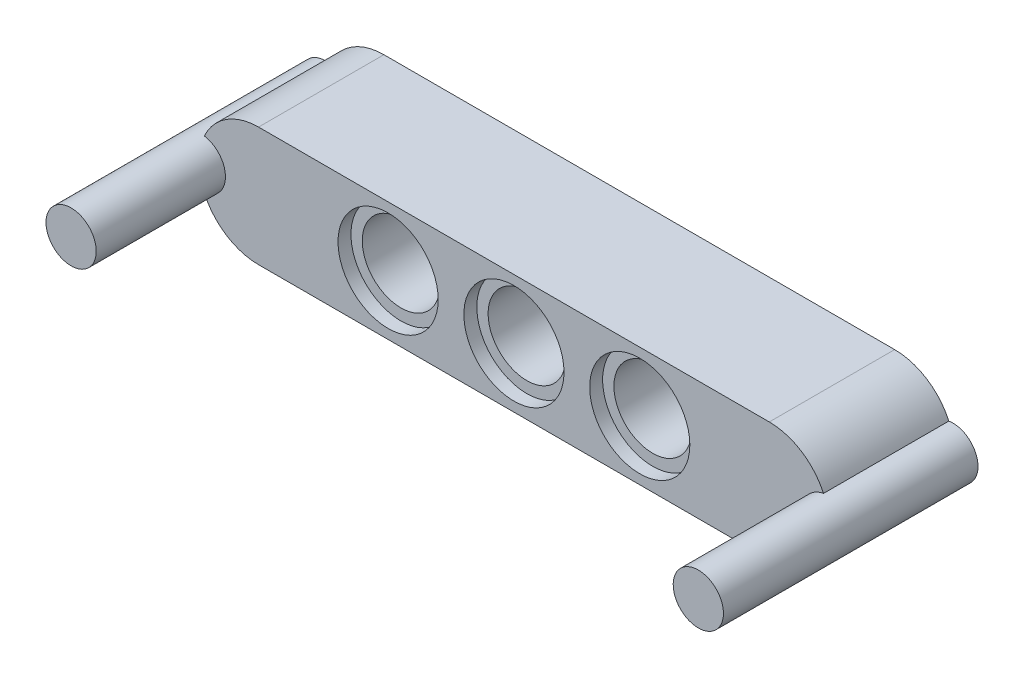
ISO-10303-21;
HEADER;
FILE_DESCRIPTION(('STEP AP214'),'2;1');
FILE_NAME('part.step','',(''),(''),'','','');
FILE_SCHEMA(('AUTOMOTIVE_DESIGN { 1 0 10303 214 1 1 1 1 }'));
ENDSEC;
DATA;
#1=APPLICATION_CONTEXT('core data for automotive mechanical design processes');
#2=APPLICATION_PROTOCOL_DEFINITION('international standard','automotive_design',2000,#1);
#3=PRODUCT_CONTEXT('',#1,'mechanical');
#4=PRODUCT('Part','Part','',(#3));
#5=PRODUCT_RELATED_PRODUCT_CATEGORY('part','',(#4));
#6=PRODUCT_DEFINITION_FORMATION('','',#4);
#7=PRODUCT_DEFINITION_CONTEXT('part definition',#1,'design');
#8=PRODUCT_DEFINITION('design','',#6,#7);
#9=PRODUCT_DEFINITION_SHAPE('','',#8);
#10=(LENGTH_UNIT() NAMED_UNIT(*) SI_UNIT(.MILLI.,.METRE.));
#11=(NAMED_UNIT(*) PLANE_ANGLE_UNIT() SI_UNIT($,.RADIAN.));
#12=(NAMED_UNIT(*) SI_UNIT($,.STERADIAN.) SOLID_ANGLE_UNIT());
#13=UNCERTAINTY_MEASURE_WITH_UNIT(LENGTH_MEASURE(1.E-05),#10,'distance_accuracy_value','');
#14=(GEOMETRIC_REPRESENTATION_CONTEXT(3) GLOBAL_UNCERTAINTY_ASSIGNED_CONTEXT((#13)) GLOBAL_UNIT_ASSIGNED_CONTEXT((#10,
#11,#12)) REPRESENTATION_CONTEXT('',''));
#15=CARTESIAN_POINT('',(0.,0.,0.));
#16=DIRECTION('',(0.,0.,1.));
#17=DIRECTION('',(1.,0.,0.));
#18=AXIS2_PLACEMENT_3D('',#15,#16,#17);
#19=CARTESIAN_POINT('',(35.31,3.69,7.76));
#20=DIRECTION('',(0.,0.,1.));
#21=DIRECTION('',(1.,0.,0.));
#22=AXIS2_PLACEMENT_3D('',#19,#20,#21);
#23=CYLINDRICAL_SURFACE('',#22,3.69);
#24=DIRECTION('',(0.,0.,-1.));
#25=VECTOR('',#24,1.);
#26=CARTESIAN_POINT('',(38.6656310679612,2.15512536807275,4.));
#27=LINE('',#26,#25);
#28=CARTESIAN_POINT('',(38.6656310679612,2.15512536807275,7.76));
#29=VERTEX_POINT('',#28);
#30=CARTESIAN_POINT('',(38.6656310679612,2.15512536807275,0.));
#31=VERTEX_POINT('',#30);
#32=EDGE_CURVE('E163',#29,#31,#27,.T.);
#33=ORIENTED_EDGE('',*,*,#32,.F.);
#34=CARTESIAN_POINT('',(35.31,3.69,7.76));
#35=DIRECTION('',(0.,0.,-1.));
#36=DIRECTION('',(-1.,0.,0.));
#37=AXIS2_PLACEMENT_3D('',#34,#35,#36);
#38=CIRCLE('',#37,3.69);
#39=CARTESIAN_POINT('',(35.31,0.,7.76));
#40=VERTEX_POINT('',#39);
#41=EDGE_CURVE('E46',#40,#29,#38,.F.);
#42=ORIENTED_EDGE('',*,*,#41,.F.);
#43=DIRECTION('',(0.,0.,1.));
#44=VECTOR('',#43,1.);
#45=CARTESIAN_POINT('',(35.31,0.,7.76));
#46=LINE('',#45,#44);
#47=CARTESIAN_POINT('',(35.31,0.,0.));
#48=VERTEX_POINT('',#47);
#49=EDGE_CURVE('E146',#48,#40,#46,.T.);
#50=ORIENTED_EDGE('',*,*,#49,.F.);
#51=CARTESIAN_POINT('',(35.31,3.69,0.));
#52=DIRECTION('',(0.,0.,-1.));
#53=DIRECTION('',(-1.,0.,0.));
#54=AXIS2_PLACEMENT_3D('',#51,#52,#53);
#55=CIRCLE('',#54,3.69);
#56=EDGE_CURVE('E149',#31,#48,#55,.T.);
#57=ORIENTED_EDGE('',*,*,#56,.F.);
#58=EDGE_LOOP('',(#33,#42,#50,#57));
#59=FACE_BOUND('',#58,.T.);
#60=ADVANCED_FACE('F39',(#59),#23,.T.);
#61=CARTESIAN_POINT('',(35.31,3.69,7.76));
#62=DIRECTION('',(0.,0.,1.));
#63=DIRECTION('',(1.,0.,0.));
#64=AXIS2_PLACEMENT_3D('',#61,#62,#63);
#65=CYLINDRICAL_SURFACE('',#64,3.69);
#66=DIRECTION('',(0.,0.,-1.));
#67=VECTOR('',#66,1.);
#68=CARTESIAN_POINT('',(38.6656310679612,5.22487463192725,4.));
#69=LINE('',#68,#67);
#70=CARTESIAN_POINT('',(38.6656310679612,5.22487463192725,0.));
#71=VERTEX_POINT('',#70);
#72=CARTESIAN_POINT('',(38.6656310679612,5.22487463192725,7.76));
#73=VERTEX_POINT('',#72);
#74=EDGE_CURVE('E60',#71,#73,#69,.F.);
#75=ORIENTED_EDGE('',*,*,#74,.F.);
#76=CARTESIAN_POINT('',(35.31,3.69,0.));
#77=DIRECTION('',(0.,0.,-1.));
#78=DIRECTION('',(-1.,0.,0.));
#79=AXIS2_PLACEMENT_3D('',#76,#77,#78);
#80=CIRCLE('',#79,3.69);
#81=CARTESIAN_POINT('',(35.31,7.38,0.));
#82=VERTEX_POINT('',#81);
#83=EDGE_CURVE('E141',#82,#71,#80,.T.);
#84=ORIENTED_EDGE('',*,*,#83,.F.);
#85=DIRECTION('',(0.,0.,1.));
#86=VECTOR('',#85,1.);
#87=CARTESIAN_POINT('',(35.31,7.38,7.76));
#88=LINE('',#87,#86);
#89=CARTESIAN_POINT('',(35.31,7.38,7.76));
#90=VERTEX_POINT('',#89);
#91=EDGE_CURVE('E138',#90,#82,#88,.F.);
#92=ORIENTED_EDGE('',*,*,#91,.F.);
#93=CARTESIAN_POINT('',(35.31,3.69,7.76));
#94=DIRECTION('',(0.,0.,-1.));
#95=DIRECTION('',(-1.,0.,0.));
#96=AXIS2_PLACEMENT_3D('',#93,#94,#95);
#97=CIRCLE('',#96,3.69);
#98=EDGE_CURVE('E144',#73,#90,#97,.F.);
#99=ORIENTED_EDGE('',*,*,#98,.F.);
#100=EDGE_LOOP('',(#75,#84,#92,#99));
#101=FACE_BOUND('',#100,.T.);
#102=ADVANCED_FACE('F264',(#101),#65,.T.);
#103=CARTESIAN_POINT('',(3.69,3.69,7.76));
#104=DIRECTION('',(0.,0.,-1.));
#105=DIRECTION('',(-1.,0.,0.));
#106=AXIS2_PLACEMENT_3D('',#103,#104,#105);
#107=CYLINDRICAL_SURFACE('',#106,3.69);
#108=DIRECTION('',(0.,0.,-1.));
#109=VECTOR('',#108,1.);
#110=CARTESIAN_POINT('',(0.334368932038836,2.15512536807275,4.));
#111=LINE('',#110,#109);
#112=CARTESIAN_POINT('',(0.334368932038836,2.15512536807275,0.));
#113=VERTEX_POINT('',#112);
#114=CARTESIAN_POINT('',(0.334368932038836,2.15512536807275,7.76));
#115=VERTEX_POINT('',#114);
#116=EDGE_CURVE('E52',#113,#115,#111,.F.);
#117=ORIENTED_EDGE('',*,*,#116,.F.);
#118=CARTESIAN_POINT('',(3.69,3.69,0.));
#119=DIRECTION('',(0.,0.,-1.));
#120=DIRECTION('',(-1.,0.,0.));
#121=AXIS2_PLACEMENT_3D('',#118,#119,#120);
#122=CIRCLE('',#121,3.69);
#123=CARTESIAN_POINT('',(3.69,0.,0.));
#124=VERTEX_POINT('',#123);
#125=EDGE_CURVE('E119',#124,#113,#122,.T.);
#126=ORIENTED_EDGE('',*,*,#125,.F.);
#127=DIRECTION('',(0.,0.,-1.));
#128=VECTOR('',#127,1.);
#129=CARTESIAN_POINT('',(3.69,0.,7.76));
#130=LINE('',#129,#128);
#131=CARTESIAN_POINT('',(3.69,0.,7.76));
#132=VERTEX_POINT('',#131);
#133=EDGE_CURVE('E127',#132,#124,#130,.T.);
#134=ORIENTED_EDGE('',*,*,#133,.F.);
#135=CARTESIAN_POINT('',(3.69,3.69,7.76));
#136=DIRECTION('',(0.,0.,-1.));
#137=DIRECTION('',(-1.,0.,0.));
#138=AXIS2_PLACEMENT_3D('',#135,#136,#137);
#139=CIRCLE('',#138,3.69);
#140=EDGE_CURVE('E135',#115,#132,#139,.F.);
#141=ORIENTED_EDGE('',*,*,#140,.F.);
#142=EDGE_LOOP('',(#117,#126,#134,#141));
#143=FACE_BOUND('',#142,.T.);
#144=ADVANCED_FACE('F269',(#143),#107,.T.);
#145=CARTESIAN_POINT('',(3.69,3.69,7.76));
#146=DIRECTION('',(0.,0.,1.));
#147=DIRECTION('',(1.,0.,0.));
#148=AXIS2_PLACEMENT_3D('',#145,#146,#147);
#149=CYLINDRICAL_SURFACE('',#148,3.69);
#150=DIRECTION('',(0.,0.,-1.));
#151=VECTOR('',#150,1.);
#152=CARTESIAN_POINT('',(0.334368932038835,5.22487463192725,4.));
#153=LINE('',#152,#151);
#154=CARTESIAN_POINT('',(0.334368932038834,5.22487463192725,7.76));
#155=VERTEX_POINT('',#154);
#156=CARTESIAN_POINT('',(0.334368932038835,5.22487463192725,0.));
#157=VERTEX_POINT('',#156);
#158=EDGE_CURVE('E101',#155,#157,#153,.T.);
#159=ORIENTED_EDGE('',*,*,#158,.F.);
#160=CARTESIAN_POINT('',(3.69,3.69,7.76));
#161=DIRECTION('',(0.,0.,-1.));
#162=DIRECTION('',(-1.,0.,0.));
#163=AXIS2_PLACEMENT_3D('',#160,#161,#162);
#164=CIRCLE('',#163,3.69);
#165=CARTESIAN_POINT('',(3.69,7.38,7.76));
#166=VERTEX_POINT('',#165);
#167=EDGE_CURVE('E125',#166,#155,#164,.F.);
#168=ORIENTED_EDGE('',*,*,#167,.F.);
#169=DIRECTION('',(0.,0.,1.));
#170=VECTOR('',#169,1.);
#171=CARTESIAN_POINT('',(3.69,7.38,7.76));
#172=LINE('',#171,#170);
#173=CARTESIAN_POINT('',(3.69,7.38,0.));
#174=VERTEX_POINT('',#173);
#175=EDGE_CURVE('E124',#174,#166,#172,.T.);
#176=ORIENTED_EDGE('',*,*,#175,.F.);
#177=CARTESIAN_POINT('',(3.69,3.69,0.));
#178=DIRECTION('',(0.,0.,-1.));
#179=DIRECTION('',(-1.,0.,0.));
#180=AXIS2_PLACEMENT_3D('',#177,#178,#179);
#181=CIRCLE('',#180,3.69);
#182=EDGE_CURVE('E116',#157,#174,#181,.T.);
#183=ORIENTED_EDGE('',*,*,#182,.F.);
#184=EDGE_LOOP('',(#159,#168,#176,#183));
#185=FACE_BOUND('',#184,.T.);
#186=ADVANCED_FACE('F122',(#185),#149,.T.);
#187=CARTESIAN_POINT('',(27.29,3.69,0.));
#188=DIRECTION('',(0.,0.,1.));
#189=DIRECTION('',(1.,0.,0.));
#190=AXIS2_PLACEMENT_3D('',#187,#188,#189);
#191=CYLINDRICAL_SURFACE('',#190,3.1);
#192=CARTESIAN_POINT('',(27.29,3.69,0.));
#193=DIRECTION('',(0.,0.,1.));
#194=DIRECTION('',(1.,0.,0.));
#195=AXIS2_PLACEMENT_3D('',#192,#193,#194);
#196=CIRCLE('',#195,3.1);
#197=CARTESIAN_POINT('',(30.39,3.69,0.));
#198=VERTEX_POINT('',#197);
#199=EDGE_CURVE('E129',#198,#198,#196,.T.);
#200=ORIENTED_EDGE('',*,*,#199,.F.);
#201=EDGE_LOOP('',(#200));
#202=FACE_BOUND('',#201,.T.);
#203=CARTESIAN_POINT('',(27.29,3.69,0.8));
#204=DIRECTION('',(0.,0.,1.));
#205=DIRECTION('',(1.,0.,0.));
#206=AXIS2_PLACEMENT_3D('',#203,#204,#205);
#207=CIRCLE('',#206,3.1);
#208=CARTESIAN_POINT('',(30.39,3.69,0.8));
#209=VERTEX_POINT('',#208);
#210=EDGE_CURVE('E229',#209,#209,#207,.T.);
#211=ORIENTED_EDGE('',*,*,#210,.T.);
#212=EDGE_LOOP('',(#211));
#213=FACE_BOUND('',#212,.T.);
#214=ADVANCED_FACE('F235',(#202,#213),#191,.F.);
#215=CARTESIAN_POINT('',(7.79,0.,0.8));
#216=DIRECTION('',(0.,0.,1.));
#217=DIRECTION('',(1.,0.,0.));
#218=AXIS2_PLACEMENT_3D('',#215,#216,#217);
#219=PLANE('',#218);
#220=ORIENTED_EDGE('',*,*,#210,.F.);
#221=EDGE_LOOP('',(#220));
#222=FACE_BOUND('',#221,.T.);
#223=CARTESIAN_POINT('',(27.29,3.69,0.8));
#224=DIRECTION('',(0.,0.,1.));
#225=DIRECTION('',(1.,0.,0.));
#226=AXIS2_PLACEMENT_3D('',#223,#224,#225);
#227=CIRCLE('',#226,2.4);
#228=CARTESIAN_POINT('',(29.69,3.69,0.8));
#229=VERTEX_POINT('',#228);
#230=EDGE_CURVE('E220',#229,#229,#227,.F.);
#231=ORIENTED_EDGE('',*,*,#230,.F.);
#232=EDGE_LOOP('',(#231));
#233=FACE_BOUND('',#232,.T.);
#234=ADVANCED_FACE('F238',(#222,#233),#219,.F.);
#235=CARTESIAN_POINT('',(7.79,0.,6.95999999999999));
#236=DIRECTION('',(0.,0.,-1.));
#237=DIRECTION('',(-1.,0.,0.));
#238=AXIS2_PLACEMENT_3D('',#235,#236,#237);
#239=PLANE('',#238);
#240=CARTESIAN_POINT('',(27.29,3.69,6.96));
#241=DIRECTION('',(0.,0.,1.));
#242=DIRECTION('',(1.,0.,0.));
#243=AXIS2_PLACEMENT_3D('',#240,#241,#242);
#244=CIRCLE('',#243,3.1);
#245=CARTESIAN_POINT('',(30.39,3.69,6.96));
#246=VERTEX_POINT('',#245);
#247=EDGE_CURVE('E226',#246,#246,#244,.T.);
#248=ORIENTED_EDGE('',*,*,#247,.T.);
#249=EDGE_LOOP('',(#248));
#250=FACE_BOUND('',#249,.T.);
#251=CARTESIAN_POINT('',(27.29,3.69,6.95999999999999));
#252=DIRECTION('',(0.,0.,-1.));
#253=DIRECTION('',(-1.,0.,0.));
#254=AXIS2_PLACEMENT_3D('',#251,#252,#253);
#255=CIRCLE('',#254,2.4);
#256=CARTESIAN_POINT('',(24.89,3.69,6.95999999999999));
#257=VERTEX_POINT('',#256);
#258=EDGE_CURVE('E217',#257,#257,#255,.F.);
#259=ORIENTED_EDGE('',*,*,#258,.F.);
#260=EDGE_LOOP('',(#259));
#261=FACE_BOUND('',#260,.T.);
#262=ADVANCED_FACE('F244',(#250,#261),#239,.F.);
#263=CARTESIAN_POINT('',(27.29,3.69,7.76));
#264=DIRECTION('',(0.,0.,-1.));
#265=DIRECTION('',(-1.,0.,0.));
#266=AXIS2_PLACEMENT_3D('',#263,#264,#265);
#267=CYLINDRICAL_SURFACE('',#266,3.1);
#268=CARTESIAN_POINT('',(27.29,3.69,7.76));
#269=DIRECTION('',(0.,0.,1.));
#270=DIRECTION('',(1.,0.,0.));
#271=AXIS2_PLACEMENT_3D('',#268,#269,#270);
#272=CIRCLE('',#271,3.1);
#273=CARTESIAN_POINT('',(30.39,3.69,7.76));
#274=VERTEX_POINT('',#273);
#275=EDGE_CURVE('E223',#274,#274,#272,.T.);
#276=ORIENTED_EDGE('',*,*,#275,.T.);
#277=EDGE_LOOP('',(#276));
#278=FACE_BOUND('',#277,.T.);
#279=ORIENTED_EDGE('',*,*,#247,.F.);
#280=EDGE_LOOP('',(#279));
#281=FACE_BOUND('',#280,.T.);
#282=ADVANCED_FACE('F251',(#278,#281),#267,.F.);
#283=CARTESIAN_POINT('',(27.29,3.69,0.));
#284=DIRECTION('',(0.,0.,1.));
#285=DIRECTION('',(1.,0.,0.));
#286=AXIS2_PLACEMENT_3D('',#283,#284,#285);
#287=CYLINDRICAL_SURFACE('',#286,2.4);
#288=ORIENTED_EDGE('',*,*,#258,.T.);
#289=EDGE_LOOP('',(#288));
#290=FACE_BOUND('',#289,.T.);
#291=ORIENTED_EDGE('',*,*,#230,.T.);
#292=EDGE_LOOP('',(#291));
#293=FACE_BOUND('',#292,.T.);
#294=ADVANCED_FACE('F248',(#290,#293),#287,.F.);
#295=CARTESIAN_POINT('',(11.71,3.69,7.76));
#296=DIRECTION('',(0.,0.,-1.));
#297=DIRECTION('',(-1.,0.,0.));
#298=AXIS2_PLACEMENT_3D('',#295,#296,#297);
#299=CYLINDRICAL_SURFACE('',#298,3.1);
#300=CARTESIAN_POINT('',(11.71,3.69,7.76));
#301=DIRECTION('',(0.,0.,1.));
#302=DIRECTION('',(1.,0.,0.));
#303=AXIS2_PLACEMENT_3D('',#300,#301,#302);
#304=CIRCLE('',#303,3.1);
#305=CARTESIAN_POINT('',(14.81,3.69,7.76));
#306=VERTEX_POINT('',#305);
#307=EDGE_CURVE('E214',#306,#306,#304,.T.);
#308=ORIENTED_EDGE('',*,*,#307,.T.);
#309=EDGE_LOOP('',(#308));
#310=FACE_BOUND('',#309,.T.);
#311=CARTESIAN_POINT('',(11.71,3.69,6.96));
#312=DIRECTION('',(0.,0.,1.));
#313=DIRECTION('',(1.,0.,0.));
#314=AXIS2_PLACEMENT_3D('',#311,#312,#313);
#315=CIRCLE('',#314,3.1);
#316=CARTESIAN_POINT('',(14.81,3.69,6.96));
#317=VERTEX_POINT('',#316);
#318=EDGE_CURVE('E205',#317,#317,#315,.T.);
#319=ORIENTED_EDGE('',*,*,#318,.F.);
#320=EDGE_LOOP('',(#319));
#321=FACE_BOUND('',#320,.T.);
#322=ADVANCED_FACE('F250',(#310,#321),#299,.F.);
#323=CARTESIAN_POINT('',(-7.79,0.,0.8));
#324=DIRECTION('',(0.,0.,1.));
#325=DIRECTION('',(1.,0.,0.));
#326=AXIS2_PLACEMENT_3D('',#323,#324,#325);
#327=PLANE('',#326);
#328=CARTESIAN_POINT('',(11.71,3.69,0.8));
#329=DIRECTION('',(0.,0.,1.));
#330=DIRECTION('',(1.,0.,0.));
#331=AXIS2_PLACEMENT_3D('',#328,#329,#330);
#332=CIRCLE('',#331,3.1);
#333=CARTESIAN_POINT('',(14.81,3.69,0.8));
#334=VERTEX_POINT('',#333);
#335=EDGE_CURVE('E211',#334,#334,#332,.T.);
#336=ORIENTED_EDGE('',*,*,#335,.F.);
#337=EDGE_LOOP('',(#336));
#338=FACE_BOUND('',#337,.T.);
#339=CARTESIAN_POINT('',(11.71,3.69,0.8));
#340=DIRECTION('',(0.,0.,1.));
#341=DIRECTION('',(1.,0.,0.));
#342=AXIS2_PLACEMENT_3D('',#339,#340,#341);
#343=CIRCLE('',#342,2.4);
#344=CARTESIAN_POINT('',(14.11,3.69,0.8));
#345=VERTEX_POINT('',#344);
#346=EDGE_CURVE('E202',#345,#345,#343,.F.);
#347=ORIENTED_EDGE('',*,*,#346,.F.);
#348=EDGE_LOOP('',(#347));
#349=FACE_BOUND('',#348,.T.);
#350=ADVANCED_FACE('F258',(#338,#349),#327,.F.);
#351=CARTESIAN_POINT('',(11.71,3.69,0.));
#352=DIRECTION('',(0.,0.,1.));
#353=DIRECTION('',(1.,0.,0.));
#354=AXIS2_PLACEMENT_3D('',#351,#352,#353);
#355=CYLINDRICAL_SURFACE('',#354,3.1);
#356=CARTESIAN_POINT('',(11.71,3.69,0.));
#357=DIRECTION('',(0.,0.,1.));
#358=DIRECTION('',(1.,0.,0.));
#359=AXIS2_PLACEMENT_3D('',#356,#357,#358);
#360=CIRCLE('',#359,3.1);
#361=CARTESIAN_POINT('',(14.81,3.69,0.));
#362=VERTEX_POINT('',#361);
#363=EDGE_CURVE('E208',#362,#362,#360,.T.);
#364=ORIENTED_EDGE('',*,*,#363,.F.);
#365=EDGE_LOOP('',(#364));
#366=FACE_BOUND('',#365,.T.);
#367=ORIENTED_EDGE('',*,*,#335,.T.);
#368=EDGE_LOOP('',(#367));
#369=FACE_BOUND('',#368,.T.);
#370=ADVANCED_FACE('F301',(#366,#369),#355,.F.);
#371=CARTESIAN_POINT('',(-7.79,0.,6.95999999999999));
#372=DIRECTION('',(0.,0.,-1.));
#373=DIRECTION('',(-1.,0.,0.));
#374=AXIS2_PLACEMENT_3D('',#371,#372,#373);
#375=PLANE('',#374);
#376=ORIENTED_EDGE('',*,*,#318,.T.);
#377=EDGE_LOOP('',(#376));
#378=FACE_BOUND('',#377,.T.);
#379=CARTESIAN_POINT('',(11.71,3.69,6.95999999999999));
#380=DIRECTION('',(0.,0.,-1.));
#381=DIRECTION('',(-1.,0.,0.));
#382=AXIS2_PLACEMENT_3D('',#379,#380,#381);
#383=CIRCLE('',#382,2.4);
#384=CARTESIAN_POINT('',(9.31,3.69,6.95999999999999));
#385=VERTEX_POINT('',#384);
#386=EDGE_CURVE('E191',#385,#385,#383,.F.);
#387=ORIENTED_EDGE('',*,*,#386,.F.);
#388=EDGE_LOOP('',(#387));
#389=FACE_BOUND('',#388,.T.);
#390=ADVANCED_FACE('F297',(#378,#389),#375,.F.);
#391=CARTESIAN_POINT('',(11.71,3.69,0.));
#392=DIRECTION('',(0.,0.,1.));
#393=DIRECTION('',(1.,0.,0.));
#394=AXIS2_PLACEMENT_3D('',#391,#392,#393);
#395=CYLINDRICAL_SURFACE('',#394,2.4);
#396=ORIENTED_EDGE('',*,*,#386,.T.);
#397=EDGE_LOOP('',(#396));
#398=FACE_BOUND('',#397,.T.);
#399=ORIENTED_EDGE('',*,*,#346,.T.);
#400=EDGE_LOOP('',(#399));
#401=FACE_BOUND('',#400,.T.);
#402=ADVANCED_FACE('F290',(#398,#401),#395,.F.);
#403=CARTESIAN_POINT('',(0.,0.,7.76));
#404=DIRECTION('',(0.,1.,0.));
#405=DIRECTION('',(0.,0.,1.));
#406=AXIS2_PLACEMENT_3D('',#403,#404,#405);
#407=PLANE('',#406);
#408=DIRECTION('',(1.,0.,0.));
#409=VECTOR('',#408,1.);
#410=CARTESIAN_POINT('',(0.,0.,0.));
#411=LINE('',#410,#409);
#412=EDGE_CURVE('E192',#124,#48,#411,.T.);
#413=ORIENTED_EDGE('',*,*,#412,.T.);
#414=ORIENTED_EDGE('',*,*,#49,.T.);
#415=DIRECTION('',(1.,0.,0.));
#416=VECTOR('',#415,1.);
#417=CARTESIAN_POINT('',(0.,0.,7.76));
#418=LINE('',#417,#416);
#419=EDGE_CURVE('E158',#132,#40,#418,.T.);
#420=ORIENTED_EDGE('',*,*,#419,.F.);
#421=ORIENTED_EDGE('',*,*,#133,.T.);
#422=EDGE_LOOP('',(#413,#414,#420,#421));
#423=FACE_BOUND('',#422,.T.);
#424=ADVANCED_FACE('F282',(#423),#407,.F.);
#425=CARTESIAN_POINT('',(0.,7.38,7.76));
#426=DIRECTION('',(0.,-1.,0.));
#427=DIRECTION('',(0.,0.,-1.));
#428=AXIS2_PLACEMENT_3D('',#425,#426,#427);
#429=PLANE('',#428);
#430=DIRECTION('',(-1.,0.,0.));
#431=VECTOR('',#430,1.);
#432=CARTESIAN_POINT('',(0.,7.38,7.76));
#433=LINE('',#432,#431);
#434=EDGE_CURVE('E188',#90,#166,#433,.T.);
#435=ORIENTED_EDGE('',*,*,#434,.F.);
#436=ORIENTED_EDGE('',*,*,#91,.T.);
#437=DIRECTION('',(-1.,0.,0.));
#438=VECTOR('',#437,1.);
#439=CARTESIAN_POINT('',(0.,7.38,0.));
#440=LINE('',#439,#438);
#441=EDGE_CURVE('E189',#82,#174,#440,.T.);
#442=ORIENTED_EDGE('',*,*,#441,.T.);
#443=ORIENTED_EDGE('',*,*,#175,.T.);
#444=EDGE_LOOP('',(#435,#436,#442,#443));
#445=FACE_BOUND('',#444,.T.);
#446=ADVANCED_FACE('F280',(#445),#429,.F.);
#447=CARTESIAN_POINT('',(0.,0.,7.76));
#448=DIRECTION('',(0.,0.,-1.));
#449=DIRECTION('',(-1.,0.,0.));
#450=AXIS2_PLACEMENT_3D('',#447,#448,#449);
#451=PLANE('',#450);
#452=CARTESIAN_POINT('',(0.0850000000000017,3.69,7.76));
#453=DIRECTION('',(0.,0.,-1.));
#454=DIRECTION('',(-1.,0.,0.));
#455=AXIS2_PLACEMENT_3D('',#452,#453,#454);
#456=CIRCLE('',#455,1.555);
#457=EDGE_CURVE('E12',#115,#155,#456,.F.);
#458=ORIENTED_EDGE('',*,*,#457,.F.);
#459=ORIENTED_EDGE('',*,*,#140,.T.);
#460=ORIENTED_EDGE('',*,*,#419,.T.);
#461=ORIENTED_EDGE('',*,*,#41,.T.);
#462=CARTESIAN_POINT('',(38.915,3.69,7.76));
#463=DIRECTION('',(0.,0.,1.));
#464=DIRECTION('',(1.,0.,0.));
#465=AXIS2_PLACEMENT_3D('',#462,#463,#464);
#466=CIRCLE('',#465,1.555);
#467=EDGE_CURVE('E155',#73,#29,#466,.T.);
#468=ORIENTED_EDGE('',*,*,#467,.F.);
#469=ORIENTED_EDGE('',*,*,#98,.T.);
#470=ORIENTED_EDGE('',*,*,#434,.T.);
#471=ORIENTED_EDGE('',*,*,#167,.T.);
#472=EDGE_LOOP('',(#458,#459,#460,#461,#468,#469,#470,#471));
#473=FACE_BOUND('',#472,.T.);
#474=ORIENTED_EDGE('',*,*,#275,.F.);
#475=EDGE_LOOP('',(#474));
#476=FACE_BOUND('',#475,.T.);
#477=ORIENTED_EDGE('',*,*,#307,.F.);
#478=EDGE_LOOP('',(#477));
#479=FACE_BOUND('',#478,.T.);
#480=CARTESIAN_POINT('',(19.5,3.69,7.76));
#481=DIRECTION('',(0.,0.,1.));
#482=DIRECTION('',(1.,0.,0.));
#483=AXIS2_PLACEMENT_3D('',#480,#481,#482);
#484=CIRCLE('',#483,3.1);
#485=CARTESIAN_POINT('',(22.6,3.69,7.76));
#486=VERTEX_POINT('',#485);
#487=EDGE_CURVE('E169',#486,#486,#484,.T.);
#488=ORIENTED_EDGE('',*,*,#487,.F.);
#489=EDGE_LOOP('',(#488));
#490=FACE_BOUND('',#489,.T.);
#491=ADVANCED_FACE('F153',(#473,#476,#479,#490),#451,.F.);
#492=CARTESIAN_POINT('',(0.,0.,0.));
#493=DIRECTION('',(0.,0.,-1.));
#494=DIRECTION('',(-1.,0.,0.));
#495=AXIS2_PLACEMENT_3D('',#492,#493,#494);
#496=PLANE('',#495);
#497=ORIENTED_EDGE('',*,*,#125,.T.);
#498=CARTESIAN_POINT('',(0.0850000000000017,3.69,0.));
#499=DIRECTION('',(0.,0.,-1.));
#500=DIRECTION('',(-1.,0.,0.));
#501=AXIS2_PLACEMENT_3D('',#498,#499,#500);
#502=CIRCLE('',#501,1.555);
#503=EDGE_CURVE('E105',#113,#157,#502,.T.);
#504=ORIENTED_EDGE('',*,*,#503,.T.);
#505=ORIENTED_EDGE('',*,*,#182,.T.);
#506=ORIENTED_EDGE('',*,*,#441,.F.);
#507=ORIENTED_EDGE('',*,*,#83,.T.);
#508=CARTESIAN_POINT('',(38.915,3.69,0.));
#509=DIRECTION('',(0.,0.,-1.));
#510=DIRECTION('',(-1.,0.,0.));
#511=AXIS2_PLACEMENT_3D('',#508,#509,#510);
#512=CIRCLE('',#511,1.555);
#513=EDGE_CURVE('E273',#71,#31,#512,.T.);
#514=ORIENTED_EDGE('',*,*,#513,.T.);
#515=ORIENTED_EDGE('',*,*,#56,.T.);
#516=ORIENTED_EDGE('',*,*,#412,.F.);
#517=EDGE_LOOP('',(#497,#504,#505,#506,#507,#514,#515,#516));
#518=FACE_BOUND('',#517,.T.);
#519=ORIENTED_EDGE('',*,*,#199,.T.);
#520=EDGE_LOOP('',(#519));
#521=FACE_BOUND('',#520,.T.);
#522=ORIENTED_EDGE('',*,*,#363,.T.);
#523=EDGE_LOOP('',(#522));
#524=FACE_BOUND('',#523,.T.);
#525=CARTESIAN_POINT('',(19.5,3.69,0.));
#526=DIRECTION('',(0.,0.,1.));
#527=DIRECTION('',(1.,0.,0.));
#528=AXIS2_PLACEMENT_3D('',#525,#526,#527);
#529=CIRCLE('',#528,3.1);
#530=CARTESIAN_POINT('',(22.6,3.69,0.));
#531=VERTEX_POINT('',#530);
#532=EDGE_CURVE('E180',#531,#531,#529,.T.);
#533=ORIENTED_EDGE('',*,*,#532,.T.);
#534=EDGE_LOOP('',(#533));
#535=FACE_BOUND('',#534,.T.);
#536=ADVANCED_FACE('F113',(#518,#521,#524,#535),#496,.T.);
#537=CARTESIAN_POINT('',(19.5,3.69,0.));
#538=DIRECTION('',(0.,0.,1.));
#539=DIRECTION('',(1.,0.,0.));
#540=AXIS2_PLACEMENT_3D('',#537,#538,#539);
#541=CYLINDRICAL_SURFACE('',#540,2.4);
#542=CARTESIAN_POINT('',(19.5,3.69,6.95999999999999));
#543=DIRECTION('',(0.,0.,-1.));
#544=DIRECTION('',(-1.,0.,0.));
#545=AXIS2_PLACEMENT_3D('',#542,#543,#544);
#546=CIRCLE('',#545,2.4);
#547=CARTESIAN_POINT('',(17.1,3.69,6.95999999999999));
#548=VERTEX_POINT('',#547);
#549=EDGE_CURVE('E179',#548,#548,#546,.F.);
#550=ORIENTED_EDGE('',*,*,#549,.T.);
#551=EDGE_LOOP('',(#550));
#552=FACE_BOUND('',#551,.T.);
#553=CARTESIAN_POINT('',(19.5,3.69,0.8));
#554=DIRECTION('',(0.,0.,1.));
#555=DIRECTION('',(1.,0.,0.));
#556=AXIS2_PLACEMENT_3D('',#553,#554,#555);
#557=CIRCLE('',#556,2.4);
#558=CARTESIAN_POINT('',(21.9,3.69,0.8));
#559=VERTEX_POINT('',#558);
#560=EDGE_CURVE('E186',#559,#559,#557,.F.);
#561=ORIENTED_EDGE('',*,*,#560,.T.);
#562=EDGE_LOOP('',(#561));
#563=FACE_BOUND('',#562,.T.);
#564=ADVANCED_FACE('F376',(#552,#563),#541,.F.);
#565=CARTESIAN_POINT('',(0.,0.,0.8));
#566=DIRECTION('',(0.,0.,1.));
#567=DIRECTION('',(1.,0.,0.));
#568=AXIS2_PLACEMENT_3D('',#565,#566,#567);
#569=PLANE('',#568);
#570=CARTESIAN_POINT('',(19.5,3.69,0.8));
#571=DIRECTION('',(0.,0.,1.));
#572=DIRECTION('',(1.,0.,0.));
#573=AXIS2_PLACEMENT_3D('',#570,#571,#572);
#574=CIRCLE('',#573,3.1);
#575=CARTESIAN_POINT('',(22.6,3.69,0.8));
#576=VERTEX_POINT('',#575);
#577=EDGE_CURVE('E183',#576,#576,#574,.T.);
#578=ORIENTED_EDGE('',*,*,#577,.F.);
#579=EDGE_LOOP('',(#578));
#580=FACE_BOUND('',#579,.T.);
#581=ORIENTED_EDGE('',*,*,#560,.F.);
#582=EDGE_LOOP('',(#581));
#583=FACE_BOUND('',#582,.T.);
#584=ADVANCED_FACE('F441',(#580,#583),#569,.F.);
#585=CARTESIAN_POINT('',(19.5,3.69,0.));
#586=DIRECTION('',(0.,0.,1.));
#587=DIRECTION('',(1.,0.,0.));
#588=AXIS2_PLACEMENT_3D('',#585,#586,#587);
#589=CYLINDRICAL_SURFACE('',#588,3.1);
#590=ORIENTED_EDGE('',*,*,#532,.F.);
#591=EDGE_LOOP('',(#590));
#592=FACE_BOUND('',#591,.T.);
#593=ORIENTED_EDGE('',*,*,#577,.T.);
#594=EDGE_LOOP('',(#593));
#595=FACE_BOUND('',#594,.T.);
#596=ADVANCED_FACE('F452',(#592,#595),#589,.F.);
#597=CARTESIAN_POINT('',(0.,0.,6.95999999999999));
#598=DIRECTION('',(0.,0.,-1.));
#599=DIRECTION('',(-1.,0.,0.));
#600=AXIS2_PLACEMENT_3D('',#597,#598,#599);
#601=PLANE('',#600);
#602=CARTESIAN_POINT('',(19.5,3.69,6.96));
#603=DIRECTION('',(0.,0.,1.));
#604=DIRECTION('',(1.,0.,0.));
#605=AXIS2_PLACEMENT_3D('',#602,#603,#604);
#606=CIRCLE('',#605,3.1);
#607=CARTESIAN_POINT('',(22.6,3.69,6.96));
#608=VERTEX_POINT('',#607);
#609=EDGE_CURVE('E176',#608,#608,#606,.T.);
#610=ORIENTED_EDGE('',*,*,#609,.T.);
#611=EDGE_LOOP('',(#610));
#612=FACE_BOUND('',#611,.T.);
#613=ORIENTED_EDGE('',*,*,#549,.F.);
#614=EDGE_LOOP('',(#613));
#615=FACE_BOUND('',#614,.T.);
#616=ADVANCED_FACE('F460',(#612,#615),#601,.F.);
#617=CARTESIAN_POINT('',(19.5,3.69,7.76));
#618=DIRECTION('',(0.,0.,-1.));
#619=DIRECTION('',(-1.,0.,0.));
#620=AXIS2_PLACEMENT_3D('',#617,#618,#619);
#621=CYLINDRICAL_SURFACE('',#620,3.1);
#622=ORIENTED_EDGE('',*,*,#487,.T.);
#623=EDGE_LOOP('',(#622));
#624=FACE_BOUND('',#623,.T.);
#625=ORIENTED_EDGE('',*,*,#609,.F.);
#626=EDGE_LOOP('',(#625));
#627=FACE_BOUND('',#626,.T.);
#628=ADVANCED_FACE('F406',(#624,#627),#621,.F.);
#629=CARTESIAN_POINT('',(38.915,3.69,15.76));
#630=DIRECTION('',(0.,0.,-1.));
#631=DIRECTION('',(-1.,0.,0.));
#632=AXIS2_PLACEMENT_3D('',#629,#630,#631);
#633=CYLINDRICAL_SURFACE('',#632,1.555);
#634=ORIENTED_EDGE('',*,*,#467,.T.);
#635=ORIENTED_EDGE('',*,*,#32,.T.);
#636=ORIENTED_EDGE('',*,*,#513,.F.);
#637=ORIENTED_EDGE('',*,*,#74,.T.);
#638=EDGE_LOOP('',(#634,#635,#636,#637));
#639=FACE_BOUND('',#638,.T.);
#640=CARTESIAN_POINT('',(38.915,3.69,15.76));
#641=DIRECTION('',(0.,0.,1.));
#642=DIRECTION('',(1.,0.,0.));
#643=AXIS2_PLACEMENT_3D('',#640,#641,#642);
#644=CIRCLE('',#643,1.555);
#645=CARTESIAN_POINT('',(40.47,3.69,15.76));
#646=VERTEX_POINT('',#645);
#647=EDGE_CURVE('E165',#646,#646,#644,.T.);
#648=ORIENTED_EDGE('',*,*,#647,.F.);
#649=EDGE_LOOP('',(#648));
#650=FACE_BOUND('',#649,.T.);
#651=ADVANCED_FACE('F161',(#639,#650),#633,.T.);
#652=CARTESIAN_POINT('',(38.915,3.69,15.76));
#653=DIRECTION('',(0.,0.,1.));
#654=DIRECTION('',(1.,0.,0.));
#655=AXIS2_PLACEMENT_3D('',#652,#653,#654);
#656=PLANE('',#655);
#657=ORIENTED_EDGE('',*,*,#647,.T.);
#658=EDGE_LOOP('',(#657));
#659=FACE_BOUND('',#658,.T.);
#660=ADVANCED_FACE('F341',(#659),#656,.T.);
#661=CARTESIAN_POINT('',(0.0850000000000017,3.69,15.76));
#662=DIRECTION('',(0.,0.,-1.));
#663=DIRECTION('',(-1.,0.,0.));
#664=AXIS2_PLACEMENT_3D('',#661,#662,#663);
#665=CYLINDRICAL_SURFACE('',#664,1.555);
#666=ORIENTED_EDGE('',*,*,#457,.T.);
#667=ORIENTED_EDGE('',*,*,#158,.T.);
#668=ORIENTED_EDGE('',*,*,#503,.F.);
#669=ORIENTED_EDGE('',*,*,#116,.T.);
#670=EDGE_LOOP('',(#666,#667,#668,#669));
#671=FACE_BOUND('',#670,.T.);
#672=CARTESIAN_POINT('',(0.0850000000000017,3.69,15.76));
#673=DIRECTION('',(0.,0.,1.));
#674=DIRECTION('',(1.,0.,0.));
#675=AXIS2_PLACEMENT_3D('',#672,#673,#674);
#676=CIRCLE('',#675,1.555);
#677=CARTESIAN_POINT('',(1.64,3.69,15.76));
#678=VERTEX_POINT('',#677);
#679=EDGE_CURVE('E166',#678,#678,#676,.T.);
#680=ORIENTED_EDGE('',*,*,#679,.F.);
#681=EDGE_LOOP('',(#680));
#682=FACE_BOUND('',#681,.T.);
#683=ADVANCED_FACE('F103',(#671,#682),#665,.T.);
#684=CARTESIAN_POINT('',(0.0850000000000017,3.69,15.76));
#685=DIRECTION('',(0.,0.,1.));
#686=DIRECTION('',(1.,0.,0.));
#687=AXIS2_PLACEMENT_3D('',#684,#685,#686);
#688=PLANE('',#687);
#689=ORIENTED_EDGE('',*,*,#679,.T.);
#690=EDGE_LOOP('',(#689));
#691=FACE_BOUND('',#690,.T.);
#692=ADVANCED_FACE('F354',(#691),#688,.T.);
#693=CLOSED_SHELL('',(#60,#102,#144,#186,#214,#234,#262,#282,#294,#322,#350,#370,#390,#402,#424,
#446,#491,#536,#564,#584,#596,#616,#628,#651,#660,#683,#692));
#694=MANIFOLD_SOLID_BREP('B2',#693);
#695=ADVANCED_BREP_SHAPE_REPRESENTATION('',(#18,#694),#14);
#696=SHAPE_DEFINITION_REPRESENTATION(#9,#695);
ENDSEC;
END-ISO-10303-21;
